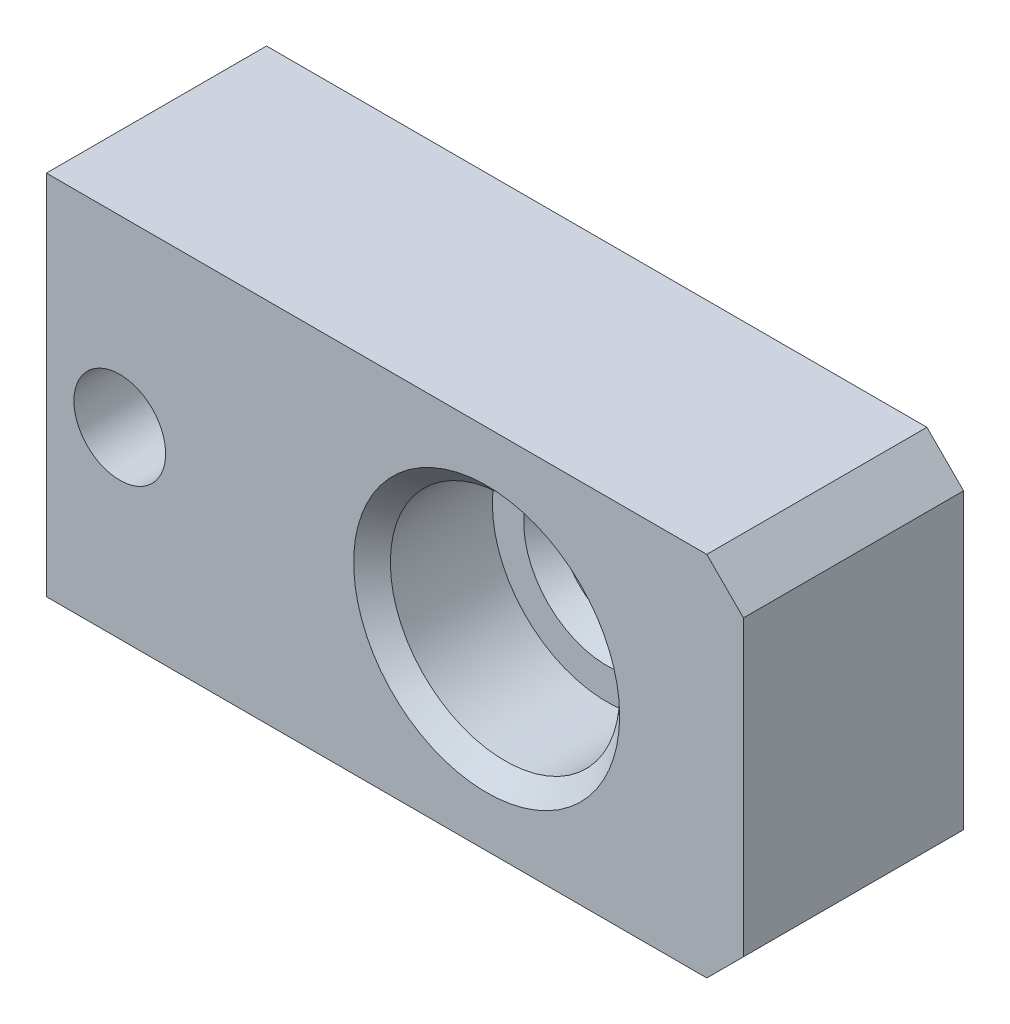
ISO-10303-21;
HEADER;
FILE_DESCRIPTION(('STEP AP214'),'2;1');
FILE_NAME('part.step','',(''),(''),'','','');
FILE_SCHEMA(('AUTOMOTIVE_DESIGN { 1 0 10303 214 1 1 1 1 }'));
ENDSEC;
DATA;
#1=APPLICATION_CONTEXT('core data for automotive mechanical design processes');
#2=APPLICATION_PROTOCOL_DEFINITION('international standard','automotive_design',2000,#1);
#3=PRODUCT_CONTEXT('',#1,'mechanical');
#4=PRODUCT('Part','Part','',(#3));
#5=PRODUCT_RELATED_PRODUCT_CATEGORY('part','',(#4));
#6=PRODUCT_DEFINITION_FORMATION('','',#4);
#7=PRODUCT_DEFINITION_CONTEXT('part definition',#1,'design');
#8=PRODUCT_DEFINITION('design','',#6,#7);
#9=PRODUCT_DEFINITION_SHAPE('','',#8);
#10=(LENGTH_UNIT() NAMED_UNIT(*) SI_UNIT(.MILLI.,.METRE.));
#11=(NAMED_UNIT(*) PLANE_ANGLE_UNIT() SI_UNIT($,.RADIAN.));
#12=(NAMED_UNIT(*) SI_UNIT($,.STERADIAN.) SOLID_ANGLE_UNIT());
#13=UNCERTAINTY_MEASURE_WITH_UNIT(LENGTH_MEASURE(1.E-05),#10,'distance_accuracy_value','');
#14=(GEOMETRIC_REPRESENTATION_CONTEXT(3) GLOBAL_UNCERTAINTY_ASSIGNED_CONTEXT((#13)) GLOBAL_UNIT_ASSIGNED_CONTEXT((#10,
#11,#12)) REPRESENTATION_CONTEXT('',''));
#15=CARTESIAN_POINT('',(0.,0.,0.));
#16=DIRECTION('',(0.,0.,1.));
#17=DIRECTION('',(1.,0.,0.));
#18=AXIS2_PLACEMENT_3D('',#15,#16,#17);
#19=CARTESIAN_POINT('',(0.,12.7,7.61999999999999));
#20=DIRECTION('',(0.,0.,-0.999999999999999));
#21=DIRECTION('',(-1.,0.,0.));
#22=AXIS2_PLACEMENT_3D('',#19,#20,#21);
#23=PLANE('',#22);
#24=CARTESIAN_POINT('',(3.81,6.35,7.62));
#25=DIRECTION('',(0.,0.,-0.999999999999999));
#26=DIRECTION('',(-1.,0.,0.));
#27=AXIS2_PLACEMENT_3D('',#24,#25,#26);
#28=CIRCLE('',#27,1.5875);
#29=CARTESIAN_POINT('',(2.2225,6.35,7.62));
#30=VERTEX_POINT('',#29);
#31=EDGE_CURVE('E208',#30,#30,#28,.T.);
#32=ORIENTED_EDGE('',*,*,#31,.T.);
#33=EDGE_LOOP('',(#32));
#34=FACE_BOUND('',#33,.T.);
#35=CARTESIAN_POINT('',(16.51,6.35,7.62));
#36=DIRECTION('',(0.,0.,0.999999999999999));
#37=DIRECTION('',(1.,0.,0.));
#38=AXIS2_PLACEMENT_3D('',#35,#36,#37);
#39=CIRCLE('',#38,4.60375);
#40=CARTESIAN_POINT('',(21.11375,6.35,7.62));
#41=VERTEX_POINT('',#40);
#42=EDGE_CURVE('E205',#41,#41,#39,.T.);
#43=ORIENTED_EDGE('',*,*,#42,.F.);
#44=EDGE_LOOP('',(#43));
#45=FACE_BOUND('',#44,.T.);
#46=DIRECTION('',(0.,1.,0.));
#47=VECTOR('',#46,1.);
#48=CARTESIAN_POINT('',(25.4,0.,7.61999999999999));
#49=LINE('',#48,#47);
#50=CARTESIAN_POINT('',(25.4,1.27,7.61999999999999));
#51=VERTEX_POINT('',#50);
#52=CARTESIAN_POINT('',(25.4,11.43,7.61999999999999));
#53=VERTEX_POINT('',#52);
#54=EDGE_CURVE('E142',#51,#53,#49,.T.);
#55=ORIENTED_EDGE('',*,*,#54,.T.);
#56=DIRECTION('',(0.707106781186547,-0.707106781186548,0.));
#57=VECTOR('',#56,1.);
#58=CARTESIAN_POINT('',(24.13,12.7,7.61999999999999));
#59=LINE('',#58,#57);
#60=CARTESIAN_POINT('',(24.13,12.7,7.61999999999999));
#61=VERTEX_POINT('',#60);
#62=EDGE_CURVE('E158',#53,#61,#59,.F.);
#63=ORIENTED_EDGE('',*,*,#62,.T.);
#64=DIRECTION('',(-1.,0.,0.));
#65=VECTOR('',#64,1.);
#66=CARTESIAN_POINT('',(0.,12.7,7.61999999999999));
#67=LINE('',#66,#65);
#68=CARTESIAN_POINT('',(1.27,12.7,7.61999999999999));
#69=VERTEX_POINT('',#68);
#70=EDGE_CURVE('E131',#61,#69,#67,.T.);
#71=ORIENTED_EDGE('',*,*,#70,.T.);
#72=DIRECTION('',(0.,-1.,0.));
#73=VECTOR('',#72,1.);
#74=CARTESIAN_POINT('',(1.27,12.7,7.61999999999999));
#75=LINE('',#74,#73);
#76=CARTESIAN_POINT('',(1.27,0.,7.61999999999999));
#77=VERTEX_POINT('',#76);
#78=EDGE_CURVE('E154',#69,#77,#75,.T.);
#79=ORIENTED_EDGE('',*,*,#78,.T.);
#80=DIRECTION('',(1.,0.,0.));
#81=VECTOR('',#80,1.);
#82=CARTESIAN_POINT('',(0.,0.,7.61999999999999));
#83=LINE('',#82,#81);
#84=CARTESIAN_POINT('',(24.13,0.,7.61999999999999));
#85=VERTEX_POINT('',#84);
#86=EDGE_CURVE('E138',#77,#85,#83,.T.);
#87=ORIENTED_EDGE('',*,*,#86,.T.);
#88=DIRECTION('',(-0.707106781186549,-0.707106781186546,0.));
#89=VECTOR('',#88,1.);
#90=CARTESIAN_POINT('',(25.4,1.27,7.61999999999999));
#91=LINE('',#90,#89);
#92=EDGE_CURVE('E156',#85,#51,#91,.F.);
#93=ORIENTED_EDGE('',*,*,#92,.T.);
#94=EDGE_LOOP('',(#55,#63,#71,#79,#87,#93));
#95=FACE_BOUND('',#94,.T.);
#96=ADVANCED_FACE('F44',(#34,#45,#95),#23,.F.);
#97=CARTESIAN_POINT('',(0.,12.7,0.));
#98=DIRECTION('',(0.,0.,-0.999999999999999));
#99=DIRECTION('',(-1.,0.,0.));
#100=AXIS2_PLACEMENT_3D('',#97,#98,#99);
#101=PLANE('',#100);
#102=CARTESIAN_POINT('',(3.81,6.35,0.));
#103=DIRECTION('',(0.,0.,-0.999999999999999));
#104=DIRECTION('',(-1.,0.,0.));
#105=AXIS2_PLACEMENT_3D('',#102,#103,#104);
#106=CIRCLE('',#105,1.905);
#107=CARTESIAN_POINT('',(1.905,6.35,0.));
#108=VERTEX_POINT('',#107);
#109=EDGE_CURVE('E220',#108,#108,#106,.T.);
#110=ORIENTED_EDGE('',*,*,#109,.F.);
#111=EDGE_LOOP('',(#110));
#112=FACE_BOUND('',#111,.T.);
#113=CARTESIAN_POINT('',(16.51,6.35,0.));
#114=DIRECTION('',(0.,0.,0.999999999999999));
#115=DIRECTION('',(1.,0.,0.));
#116=AXIS2_PLACEMENT_3D('',#113,#114,#115);
#117=CIRCLE('',#116,2.8829);
#118=CARTESIAN_POINT('',(19.3929,6.35,0.));
#119=VERTEX_POINT('',#118);
#120=EDGE_CURVE('E171',#119,#119,#117,.T.);
#121=ORIENTED_EDGE('',*,*,#120,.T.);
#122=EDGE_LOOP('',(#121));
#123=FACE_BOUND('',#122,.T.);
#124=DIRECTION('',(-1.,0.,0.));
#125=VECTOR('',#124,1.);
#126=CARTESIAN_POINT('',(0.,12.7,0.));
#127=LINE('',#126,#125);
#128=CARTESIAN_POINT('',(24.13,12.7,0.));
#129=VERTEX_POINT('',#128);
#130=CARTESIAN_POINT('',(1.27,12.7,0.));
#131=VERTEX_POINT('',#130);
#132=EDGE_CURVE('E129',#129,#131,#127,.T.);
#133=ORIENTED_EDGE('',*,*,#132,.F.);
#134=DIRECTION('',(-0.707106781186547,0.707106781186548,0.));
#135=VECTOR('',#134,1.);
#136=CARTESIAN_POINT('',(12.065,24.765,0.));
#137=LINE('',#136,#135);
#138=CARTESIAN_POINT('',(25.4,11.43,0.));
#139=VERTEX_POINT('',#138);
#140=EDGE_CURVE('E111',#129,#139,#137,.F.);
#141=ORIENTED_EDGE('',*,*,#140,.T.);
#142=DIRECTION('',(0.,1.,0.));
#143=VECTOR('',#142,1.);
#144=CARTESIAN_POINT('',(25.4,0.,0.));
#145=LINE('',#144,#143);
#146=CARTESIAN_POINT('',(25.4,1.27,0.));
#147=VERTEX_POINT('',#146);
#148=EDGE_CURVE('E139',#147,#139,#145,.T.);
#149=ORIENTED_EDGE('',*,*,#148,.F.);
#150=DIRECTION('',(0.707106781186549,0.707106781186546,0.));
#151=VECTOR('',#150,1.);
#152=CARTESIAN_POINT('',(18.415,-5.71500000000002,0.));
#153=LINE('',#152,#151);
#154=CARTESIAN_POINT('',(24.13,0.,0.));
#155=VERTEX_POINT('',#154);
#156=EDGE_CURVE('E122',#147,#155,#153,.F.);
#157=ORIENTED_EDGE('',*,*,#156,.T.);
#158=DIRECTION('',(1.,0.,0.));
#159=VECTOR('',#158,1.);
#160=CARTESIAN_POINT('',(0.,0.,0.));
#161=LINE('',#160,#159);
#162=CARTESIAN_POINT('',(1.27,0.,0.));
#163=VERTEX_POINT('',#162);
#164=EDGE_CURVE('E144',#163,#155,#161,.T.);
#165=ORIENTED_EDGE('',*,*,#164,.F.);
#166=DIRECTION('',(0.,1.,0.));
#167=VECTOR('',#166,1.);
#168=CARTESIAN_POINT('',(1.27,12.7,0.));
#169=LINE('',#168,#167);
#170=EDGE_CURVE('E132',#163,#131,#169,.T.);
#171=ORIENTED_EDGE('',*,*,#170,.T.);
#172=EDGE_LOOP('',(#133,#141,#149,#157,#165,#171));
#173=FACE_BOUND('',#172,.T.);
#174=ADVANCED_FACE('F135',(#112,#123,#173),#101,.T.);
#175=CARTESIAN_POINT('',(0.,0.,7.61999999999999));
#176=DIRECTION('',(1.,0.,0.));
#177=DIRECTION('',(0.,0.,-0.999999999999999));
#178=AXIS2_PLACEMENT_3D('',#175,#176,#177);
#179=PLANE('',#178);
#180=DIRECTION('',(0.,1.,0.));
#181=VECTOR('',#180,1.);
#182=CARTESIAN_POINT('',(0.,0.,6.34999999999999));
#183=LINE('',#182,#181);
#184=CARTESIAN_POINT('',(0.,1.27,6.34999999999999));
#185=VERTEX_POINT('',#184);
#186=CARTESIAN_POINT('',(0.,11.43,6.34999999999999));
#187=VERTEX_POINT('',#186);
#188=EDGE_CURVE('E164',#185,#187,#183,.T.);
#189=ORIENTED_EDGE('',*,*,#188,.T.);
#190=DIRECTION('',(0.,0.,-0.999999999999999));
#191=VECTOR('',#190,1.);
#192=CARTESIAN_POINT('',(0.,11.43,7.61999999999999));
#193=LINE('',#192,#191);
#194=CARTESIAN_POINT('',(0.,11.43,1.27));
#195=VERTEX_POINT('',#194);
#196=EDGE_CURVE('E13',#187,#195,#193,.T.);
#197=ORIENTED_EDGE('',*,*,#196,.T.);
#198=DIRECTION('',(0.,-1.,0.));
#199=VECTOR('',#198,1.);
#200=CARTESIAN_POINT('',(0.,0.,1.27));
#201=LINE('',#200,#199);
#202=CARTESIAN_POINT('',(0.,1.27,1.27));
#203=VERTEX_POINT('',#202);
#204=EDGE_CURVE('E53',#195,#203,#201,.T.);
#205=ORIENTED_EDGE('',*,*,#204,.T.);
#206=DIRECTION('',(0.,0.,0.999999999999999));
#207=VECTOR('',#206,1.);
#208=CARTESIAN_POINT('',(0.,1.27,7.61999999999999));
#209=LINE('',#208,#207);
#210=EDGE_CURVE('E166',#203,#185,#209,.T.);
#211=ORIENTED_EDGE('',*,*,#210,.T.);
#212=EDGE_LOOP('',(#189,#197,#205,#211));
#213=FACE_BOUND('',#212,.T.);
#214=ADVANCED_FACE('F228',(#213),#179,.F.);
#215=CARTESIAN_POINT('',(0.,0.,7.61999999999999));
#216=DIRECTION('',(0.,1.,0.));
#217=DIRECTION('',(0.,0.,0.999999999999999));
#218=AXIS2_PLACEMENT_3D('',#215,#216,#217);
#219=PLANE('',#218);
#220=ORIENTED_EDGE('',*,*,#164,.T.);
#221=DIRECTION('',(0.,0.,0.999999999999999));
#222=VECTOR('',#221,1.);
#223=CARTESIAN_POINT('',(24.13,0.,7.61999999999999));
#224=LINE('',#223,#222);
#225=EDGE_CURVE('E162',#155,#85,#224,.T.);
#226=ORIENTED_EDGE('',*,*,#225,.T.);
#227=ORIENTED_EDGE('',*,*,#86,.F.);
#228=DIRECTION('',(0.,0.,-0.999999999999999));
#229=VECTOR('',#228,1.);
#230=CARTESIAN_POINT('',(1.27,0.,7.61999999999999));
#231=LINE('',#230,#229);
#232=EDGE_CURVE('E160',#77,#163,#231,.T.);
#233=ORIENTED_EDGE('',*,*,#232,.T.);
#234=EDGE_LOOP('',(#220,#226,#227,#233));
#235=FACE_BOUND('',#234,.T.);
#236=ADVANCED_FACE('F287',(#235),#219,.F.);
#237=CARTESIAN_POINT('',(25.4,0.,7.61999999999999));
#238=DIRECTION('',(-1.,0.,0.));
#239=DIRECTION('',(0.,0.,0.999999999999999));
#240=AXIS2_PLACEMENT_3D('',#237,#238,#239);
#241=PLANE('',#240);
#242=ORIENTED_EDGE('',*,*,#148,.T.);
#243=DIRECTION('',(0.,0.,0.999999999999999));
#244=VECTOR('',#243,1.);
#245=CARTESIAN_POINT('',(25.4,11.43,7.61999999999999));
#246=LINE('',#245,#244);
#247=EDGE_CURVE('E116',#139,#53,#246,.T.);
#248=ORIENTED_EDGE('',*,*,#247,.T.);
#249=ORIENTED_EDGE('',*,*,#54,.F.);
#250=DIRECTION('',(0.,0.,-0.999999999999999));
#251=VECTOR('',#250,1.);
#252=CARTESIAN_POINT('',(25.4,1.27,7.61999999999999));
#253=LINE('',#252,#251);
#254=EDGE_CURVE('E121',#51,#147,#253,.T.);
#255=ORIENTED_EDGE('',*,*,#254,.T.);
#256=EDGE_LOOP('',(#242,#248,#249,#255));
#257=FACE_BOUND('',#256,.T.);
#258=ADVANCED_FACE('F278',(#257),#241,.F.);
#259=CARTESIAN_POINT('',(0.,12.7,7.61999999999999));
#260=DIRECTION('',(0.,-1.,0.));
#261=DIRECTION('',(0.,0.,-0.999999999999999));
#262=AXIS2_PLACEMENT_3D('',#259,#260,#261);
#263=PLANE('',#262);
#264=ORIENTED_EDGE('',*,*,#70,.F.);
#265=DIRECTION('',(0.,0.,-0.999999999999999));
#266=VECTOR('',#265,1.);
#267=CARTESIAN_POINT('',(24.13,12.7,7.61999999999999));
#268=LINE('',#267,#266);
#269=EDGE_CURVE('E115',#61,#129,#268,.T.);
#270=ORIENTED_EDGE('',*,*,#269,.T.);
#271=ORIENTED_EDGE('',*,*,#132,.T.);
#272=DIRECTION('',(0.,0.,0.999999999999999));
#273=VECTOR('',#272,1.);
#274=CARTESIAN_POINT('',(1.27,12.7,7.61999999999999));
#275=LINE('',#274,#273);
#276=EDGE_CURVE('E133',#131,#69,#275,.T.);
#277=ORIENTED_EDGE('',*,*,#276,.T.);
#278=EDGE_LOOP('',(#264,#270,#271,#277));
#279=FACE_BOUND('',#278,.T.);
#280=ADVANCED_FACE('F127',(#279),#263,.F.);
#281=CARTESIAN_POINT('',(24.13,12.7,7.61999999999999));
#282=DIRECTION('',(-0.707106781186548,-0.707106781186547,0.));
#283=DIRECTION('',(0.707106781186547,-0.707106781186548,0.));
#284=AXIS2_PLACEMENT_3D('',#281,#282,#283);
#285=PLANE('',#284);
#286=ORIENTED_EDGE('',*,*,#62,.F.);
#287=ORIENTED_EDGE('',*,*,#247,.F.);
#288=ORIENTED_EDGE('',*,*,#140,.F.);
#289=ORIENTED_EDGE('',*,*,#269,.F.);
#290=EDGE_LOOP('',(#286,#287,#288,#289));
#291=FACE_BOUND('',#290,.T.);
#292=ADVANCED_FACE('F114',(#291),#285,.F.);
#293=CARTESIAN_POINT('',(25.4,1.27,7.61999999999999));
#294=DIRECTION('',(-0.707106781186546,0.707106781186549,0.));
#295=DIRECTION('',(-0.707106781186549,-0.707106781186546,0.));
#296=AXIS2_PLACEMENT_3D('',#293,#294,#295);
#297=PLANE('',#296);
#298=ORIENTED_EDGE('',*,*,#92,.F.);
#299=ORIENTED_EDGE('',*,*,#225,.F.);
#300=ORIENTED_EDGE('',*,*,#156,.F.);
#301=ORIENTED_EDGE('',*,*,#254,.F.);
#302=EDGE_LOOP('',(#298,#299,#300,#301));
#303=FACE_BOUND('',#302,.T.);
#304=ADVANCED_FACE('F280',(#303),#297,.F.);
#305=CARTESIAN_POINT('',(1.27,0.,7.61999999999999));
#306=DIRECTION('',(0.707106781186548,0.707106781186547,0.));
#307=DIRECTION('',(-0.707106781186547,0.707106781186548,0.));
#308=AXIS2_PLACEMENT_3D('',#305,#306,#307);
#309=PLANE('',#308);
#310=DIRECTION('',(-0.577350269189625,0.577350269189626,0.577350269189626));
#311=VECTOR('',#310,1.);
#312=CARTESIAN_POINT('',(-1.27,2.54,2.54000000000001));
#313=LINE('',#312,#311);
#314=EDGE_CURVE('E172',#163,#203,#313,.T.);
#315=ORIENTED_EDGE('',*,*,#314,.F.);
#316=ORIENTED_EDGE('',*,*,#232,.F.);
#317=DIRECTION('',(0.577350269189625,-0.577350269189626,0.577350269189626));
#318=VECTOR('',#317,1.);
#319=CARTESIAN_POINT('',(-2.96333333333333,4.23333333333334,3.38666666666666));
#320=LINE('',#319,#318);
#321=EDGE_CURVE('E48',#185,#77,#320,.T.);
#322=ORIENTED_EDGE('',*,*,#321,.F.);
#323=ORIENTED_EDGE('',*,*,#210,.F.);
#324=EDGE_LOOP('',(#315,#316,#322,#323));
#325=FACE_BOUND('',#324,.T.);
#326=ADVANCED_FACE('F46',(#325),#309,.F.);
#327=CARTESIAN_POINT('',(1.27,12.7,7.61999999999999));
#328=DIRECTION('',(0.707106781186549,0.,-0.707106781186546));
#329=DIRECTION('',(-0.707106781186546,0.,-0.707106781186548));
#330=AXIS2_PLACEMENT_3D('',#327,#328,#329);
#331=PLANE('',#330);
#332=ORIENTED_EDGE('',*,*,#321,.T.);
#333=ORIENTED_EDGE('',*,*,#78,.F.);
#334=DIRECTION('',(-0.577350269189624,-0.577350269189627,-0.577350269189626));
#335=VECTOR('',#334,1.);
#336=CARTESIAN_POINT('',(1.27,12.7,7.61999999999999));
#337=LINE('',#336,#335);
#338=EDGE_CURVE('E170',#187,#69,#337,.F.);
#339=ORIENTED_EDGE('',*,*,#338,.F.);
#340=ORIENTED_EDGE('',*,*,#188,.F.);
#341=EDGE_LOOP('',(#332,#333,#339,#340));
#342=FACE_BOUND('',#341,.T.);
#343=ADVANCED_FACE('F285',(#342),#331,.F.);
#344=CARTESIAN_POINT('',(0.,0.,1.27));
#345=DIRECTION('',(-0.707106781186549,0.,-0.707106781186546));
#346=DIRECTION('',(-0.707106781186546,0.,0.707106781186548));
#347=AXIS2_PLACEMENT_3D('',#344,#345,#346);
#348=PLANE('',#347);
#349=ORIENTED_EDGE('',*,*,#314,.T.);
#350=ORIENTED_EDGE('',*,*,#204,.F.);
#351=DIRECTION('',(-0.577350269189624,-0.577350269189627,0.577350269189626));
#352=VECTOR('',#351,1.);
#353=CARTESIAN_POINT('',(-3.81,7.61999999999998,5.08000000000001));
#354=LINE('',#353,#352);
#355=EDGE_CURVE('E61',#131,#195,#354,.T.);
#356=ORIENTED_EDGE('',*,*,#355,.F.);
#357=ORIENTED_EDGE('',*,*,#170,.F.);
#358=EDGE_LOOP('',(#349,#350,#356,#357));
#359=FACE_BOUND('',#358,.T.);
#360=ADVANCED_FACE('F283',(#359),#348,.T.);
#361=CARTESIAN_POINT('',(0.,11.43,7.61999999999999));
#362=DIRECTION('',(0.707106781186549,-0.707106781186546,0.));
#363=DIRECTION('',(0.707106781186546,0.707106781186549,0.));
#364=AXIS2_PLACEMENT_3D('',#361,#362,#363);
#365=PLANE('',#364);
#366=ORIENTED_EDGE('',*,*,#338,.T.);
#367=ORIENTED_EDGE('',*,*,#276,.F.);
#368=ORIENTED_EDGE('',*,*,#355,.T.);
#369=ORIENTED_EDGE('',*,*,#196,.F.);
#370=EDGE_LOOP('',(#366,#367,#368,#369));
#371=FACE_BOUND('',#370,.T.);
#372=ADVANCED_FACE('F236',(#371),#365,.F.);
#373=CARTESIAN_POINT('',(16.51,6.35,0.634999999999993));
#374=DIRECTION('',(0.,0.,-0.999999999999999));
#375=DIRECTION('',(-1.,0.,0.));
#376=AXIS2_PLACEMENT_3D('',#373,#374,#375);
#377=CONICAL_SURFACE('',#376,2.2479,0.785398163397451);
#378=ORIENTED_EDGE('',*,*,#120,.F.);
#379=EDGE_LOOP('',(#378));
#380=FACE_BOUND('',#379,.T.);
#381=CARTESIAN_POINT('',(16.51,6.35,0.634999999999993));
#382=DIRECTION('',(0.,0.,0.999999999999999));
#383=DIRECTION('',(1.,0.,0.));
#384=AXIS2_PLACEMENT_3D('',#381,#382,#383);
#385=CIRCLE('',#384,2.2479);
#386=CARTESIAN_POINT('',(18.7579,6.35,0.634999999999993));
#387=VERTEX_POINT('',#386);
#388=EDGE_CURVE('E190',#387,#387,#385,.T.);
#389=ORIENTED_EDGE('',*,*,#388,.T.);
#390=EDGE_LOOP('',(#389));
#391=FACE_BOUND('',#390,.T.);
#392=ADVANCED_FACE('F232',(#380,#391),#377,.F.);
#393=CARTESIAN_POINT('',(16.51,6.35,7.61999999999999));
#394=DIRECTION('',(0.,0.,0.999999999999999));
#395=DIRECTION('',(1.,0.,0.));
#396=AXIS2_PLACEMENT_3D('',#393,#394,#395);
#397=CYLINDRICAL_SURFACE('',#396,2.2479);
#398=ORIENTED_EDGE('',*,*,#388,.F.);
#399=EDGE_LOOP('',(#398));
#400=FACE_BOUND('',#399,.T.);
#401=CARTESIAN_POINT('',(16.51,6.35,2.81940000000001));
#402=DIRECTION('',(0.,0.,0.999999999999999));
#403=DIRECTION('',(1.,0.,0.));
#404=AXIS2_PLACEMENT_3D('',#401,#402,#403);
#405=CIRCLE('',#404,2.2479);
#406=CARTESIAN_POINT('',(18.7579,6.35,2.81940000000001));
#407=VERTEX_POINT('',#406);
#408=EDGE_CURVE('E193',#407,#407,#405,.T.);
#409=ORIENTED_EDGE('',*,*,#408,.T.);
#410=EDGE_LOOP('',(#409));
#411=FACE_BOUND('',#410,.T.);
#412=ADVANCED_FACE('F235',(#400,#411),#397,.F.);
#413=CARTESIAN_POINT('',(16.51,6.35,3.4544));
#414=DIRECTION('',(0.,0.,0.999999999999999));
#415=DIRECTION('',(1.,0.,0.));
#416=AXIS2_PLACEMENT_3D('',#413,#414,#415);
#417=CONICAL_SURFACE('',#416,2.8829,0.785398163397454);
#418=ORIENTED_EDGE('',*,*,#408,.F.);
#419=EDGE_LOOP('',(#418));
#420=FACE_BOUND('',#419,.T.);
#421=CARTESIAN_POINT('',(16.51,6.35,3.4544));
#422=DIRECTION('',(0.,0.,0.999999999999999));
#423=DIRECTION('',(1.,0.,0.));
#424=AXIS2_PLACEMENT_3D('',#421,#422,#423);
#425=CIRCLE('',#424,2.8829);
#426=CARTESIAN_POINT('',(19.3929,6.35,3.4544));
#427=VERTEX_POINT('',#426);
#428=EDGE_CURVE('E196',#427,#427,#425,.T.);
#429=ORIENTED_EDGE('',*,*,#428,.T.);
#430=EDGE_LOOP('',(#429));
#431=FACE_BOUND('',#430,.T.);
#432=ADVANCED_FACE('F242',(#420,#431),#417,.F.);
#433=CARTESIAN_POINT('',(19.3929,6.35,3.4544));
#434=DIRECTION('',(0.,0.,-0.999999999999999));
#435=DIRECTION('',(-1.,0.,0.));
#436=AXIS2_PLACEMENT_3D('',#433,#434,#435);
#437=PLANE('',#436);
#438=ORIENTED_EDGE('',*,*,#428,.F.);
#439=EDGE_LOOP('',(#438));
#440=FACE_BOUND('',#439,.T.);
#441=CARTESIAN_POINT('',(16.51,6.35,3.45440000000001));
#442=DIRECTION('',(0.,0.,0.999999999999999));
#443=DIRECTION('',(1.,0.,0.));
#444=AXIS2_PLACEMENT_3D('',#441,#442,#443);
#445=CIRCLE('',#444,3.96875);
#446=CARTESIAN_POINT('',(20.47875,6.35,3.45440000000001));
#447=VERTEX_POINT('',#446);
#448=EDGE_CURVE('E199',#447,#447,#445,.T.);
#449=ORIENTED_EDGE('',*,*,#448,.T.);
#450=EDGE_LOOP('',(#449));
#451=FACE_BOUND('',#450,.T.);
#452=ADVANCED_FACE('F248',(#440,#451),#437,.F.);
#453=CARTESIAN_POINT('',(16.51,6.35,7.61999999999999));
#454=DIRECTION('',(0.,0.,0.999999999999999));
#455=DIRECTION('',(1.,0.,0.));
#456=AXIS2_PLACEMENT_3D('',#453,#454,#455);
#457=CYLINDRICAL_SURFACE('',#456,3.96875);
#458=ORIENTED_EDGE('',*,*,#448,.F.);
#459=EDGE_LOOP('',(#458));
#460=FACE_BOUND('',#459,.T.);
#461=CARTESIAN_POINT('',(16.51,6.35,6.985));
#462=DIRECTION('',(0.,0.,0.999999999999999));
#463=DIRECTION('',(1.,0.,0.));
#464=AXIS2_PLACEMENT_3D('',#461,#462,#463);
#465=CIRCLE('',#464,3.96875);
#466=CARTESIAN_POINT('',(20.47875,6.35,6.985));
#467=VERTEX_POINT('',#466);
#468=EDGE_CURVE('E202',#467,#467,#465,.T.);
#469=ORIENTED_EDGE('',*,*,#468,.T.);
#470=EDGE_LOOP('',(#469));
#471=FACE_BOUND('',#470,.T.);
#472=ADVANCED_FACE('F254',(#460,#471),#457,.F.);
#473=CARTESIAN_POINT('',(16.51,6.35,7.62));
#474=DIRECTION('',(0.,0.,0.999999999999999));
#475=DIRECTION('',(1.,0.,0.));
#476=AXIS2_PLACEMENT_3D('',#473,#474,#475);
#477=CONICAL_SURFACE('',#476,4.60375,0.785398163397446);
#478=ORIENTED_EDGE('',*,*,#468,.F.);
#479=EDGE_LOOP('',(#478));
#480=FACE_BOUND('',#479,.T.);
#481=ORIENTED_EDGE('',*,*,#42,.T.);
#482=EDGE_LOOP('',(#481));
#483=FACE_BOUND('',#482,.T.);
#484=ADVANCED_FACE('F260',(#480,#483),#477,.F.);
#485=CARTESIAN_POINT('',(3.81,6.35,0.));
#486=DIRECTION('',(0.,0.,-0.999999999999999));
#487=DIRECTION('',(-1.,0.,0.));
#488=AXIS2_PLACEMENT_3D('',#485,#486,#487);
#489=CYLINDRICAL_SURFACE('',#488,1.5875);
#490=ORIENTED_EDGE('',*,*,#31,.F.);
#491=EDGE_LOOP('',(#490));
#492=FACE_BOUND('',#491,.T.);
#493=CARTESIAN_POINT('',(3.81,6.35,1.524));
#494=DIRECTION('',(0.,0.,-0.999999999999999));
#495=DIRECTION('',(-1.,0.,0.));
#496=AXIS2_PLACEMENT_3D('',#493,#494,#495);
#497=CIRCLE('',#496,1.5875);
#498=CARTESIAN_POINT('',(2.2225,6.35,1.524));
#499=VERTEX_POINT('',#498);
#500=EDGE_CURVE('E211',#499,#499,#497,.T.);
#501=ORIENTED_EDGE('',*,*,#500,.T.);
#502=EDGE_LOOP('',(#501));
#503=FACE_BOUND('',#502,.T.);
#504=ADVANCED_FACE('F266',(#492,#503),#489,.F.);
#505=CARTESIAN_POINT('',(5.4102,6.35,1.524));
#506=DIRECTION('',(0.,0.,0.999999999999999));
#507=DIRECTION('',(1.,0.,0.));
#508=AXIS2_PLACEMENT_3D('',#505,#506,#507);
#509=PLANE('',#508);
#510=ORIENTED_EDGE('',*,*,#500,.F.);
#511=EDGE_LOOP('',(#510));
#512=FACE_BOUND('',#511,.T.);
#513=CARTESIAN_POINT('',(3.81,6.35,1.524));
#514=DIRECTION('',(0.,0.,-0.999999999999999));
#515=DIRECTION('',(-1.,0.,0.));
#516=AXIS2_PLACEMENT_3D('',#513,#514,#515);
#517=CIRCLE('',#516,1.6002);
#518=CARTESIAN_POINT('',(2.2098,6.35,1.524));
#519=VERTEX_POINT('',#518);
#520=EDGE_CURVE('E214',#519,#519,#517,.T.);
#521=ORIENTED_EDGE('',*,*,#520,.T.);
#522=EDGE_LOOP('',(#521));
#523=FACE_BOUND('',#522,.T.);
#524=ADVANCED_FACE('F412',(#512,#523),#509,.F.);
#525=CARTESIAN_POINT('',(3.81,6.35,0.));
#526=DIRECTION('',(0.,0.,-0.999999999999999));
#527=DIRECTION('',(-1.,0.,0.));
#528=AXIS2_PLACEMENT_3D('',#525,#526,#527);
#529=CYLINDRICAL_SURFACE('',#528,1.6002);
#530=ORIENTED_EDGE('',*,*,#520,.F.);
#531=EDGE_LOOP('',(#530));
#532=FACE_BOUND('',#531,.T.);
#533=CARTESIAN_POINT('',(3.81,6.35,0.304800000000001));
#534=DIRECTION('',(0.,0.,-0.999999999999999));
#535=DIRECTION('',(-1.,0.,0.));
#536=AXIS2_PLACEMENT_3D('',#533,#534,#535);
#537=CIRCLE('',#536,1.6002);
#538=CARTESIAN_POINT('',(2.2098,6.35,0.304800000000001));
#539=VERTEX_POINT('',#538);
#540=EDGE_CURVE('E217',#539,#539,#537,.T.);
#541=ORIENTED_EDGE('',*,*,#540,.T.);
#542=EDGE_LOOP('',(#541));
#543=FACE_BOUND('',#542,.T.);
#544=ADVANCED_FACE('F421',(#532,#543),#529,.F.);
#545=CARTESIAN_POINT('',(3.81,6.35,0.));
#546=DIRECTION('',(0.,0.,-0.999999999999999));
#547=DIRECTION('',(-1.,0.,0.));
#548=AXIS2_PLACEMENT_3D('',#545,#546,#547);
#549=CONICAL_SURFACE('',#548,1.905,0.785398163397448);
#550=ORIENTED_EDGE('',*,*,#540,.F.);
#551=EDGE_LOOP('',(#550));
#552=FACE_BOUND('',#551,.T.);
#553=ORIENTED_EDGE('',*,*,#109,.T.);
#554=EDGE_LOOP('',(#553));
#555=FACE_BOUND('',#554,.T.);
#556=ADVANCED_FACE('F224',(#552,#555),#549,.F.);
#557=CLOSED_SHELL('',(#96,#174,#214,#236,#258,#280,#292,#304,#326,#343,#360,#372,#392,#412,#432,
#452,#472,#484,#504,#524,#544,#556));
#558=MANIFOLD_SOLID_BREP('B2',#557);
#559=ADVANCED_BREP_SHAPE_REPRESENTATION('',(#18,#558),#14);
#560=SHAPE_DEFINITION_REPRESENTATION(#9,#559);
ENDSEC;
END-ISO-10303-21;
